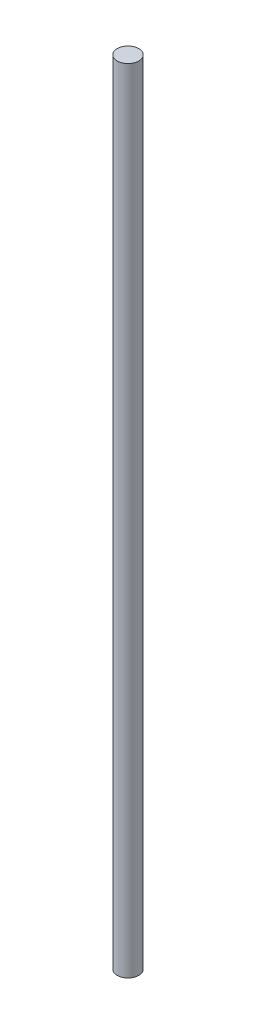
ISO-10303-21;
HEADER;
FILE_DESCRIPTION(('STEP AP214'),'2;1');
FILE_NAME('part.step','',(''),(''),'','','');
FILE_SCHEMA(('AUTOMOTIVE_DESIGN { 1 0 10303 214 1 1 1 1 }'));
ENDSEC;
DATA;
#1=APPLICATION_CONTEXT('core data for automotive mechanical design processes');
#2=APPLICATION_PROTOCOL_DEFINITION('international standard','automotive_design',2000,#1);
#3=PRODUCT_CONTEXT('',#1,'mechanical');
#4=PRODUCT('Part','Part','',(#3));
#5=PRODUCT_RELATED_PRODUCT_CATEGORY('part','',(#4));
#6=PRODUCT_DEFINITION_FORMATION('','',#4);
#7=PRODUCT_DEFINITION_CONTEXT('part definition',#1,'design');
#8=PRODUCT_DEFINITION('design','',#6,#7);
#9=PRODUCT_DEFINITION_SHAPE('','',#8);
#10=(LENGTH_UNIT() NAMED_UNIT(*) SI_UNIT(.MILLI.,.METRE.));
#11=(NAMED_UNIT(*) PLANE_ANGLE_UNIT() SI_UNIT($,.RADIAN.));
#12=(NAMED_UNIT(*) SI_UNIT($,.STERADIAN.) SOLID_ANGLE_UNIT());
#13=UNCERTAINTY_MEASURE_WITH_UNIT(LENGTH_MEASURE(1.E-05),#10,'distance_accuracy_value','');
#14=(GEOMETRIC_REPRESENTATION_CONTEXT(3) GLOBAL_UNCERTAINTY_ASSIGNED_CONTEXT((#13)) GLOBAL_UNIT_ASSIGNED_CONTEXT((#10,
#11,#12)) REPRESENTATION_CONTEXT('',''));
#15=CARTESIAN_POINT('',(0.,0.,0.));
#16=DIRECTION('',(0.,0.,1.));
#17=DIRECTION('',(1.,0.,0.));
#18=AXIS2_PLACEMENT_3D('',#15,#16,#17);
#19=CARTESIAN_POINT('',(0.,79.,0.));
#20=DIRECTION('',(0.,-1.,0.));
#21=DIRECTION('',(0.,0.,-1.));
#22=AXIS2_PLACEMENT_3D('',#19,#20,#21);
#23=CYLINDRICAL_SURFACE('',#22,1.075);
#24=CARTESIAN_POINT('',(0.,79.,0.));
#25=DIRECTION('',(0.,1.,0.));
#26=DIRECTION('',(0.,0.,1.));
#27=AXIS2_PLACEMENT_3D('',#24,#25,#26);
#28=CIRCLE('',#27,1.075);
#29=CARTESIAN_POINT('',(0.,79.,1.075));
#30=VERTEX_POINT('',#29);
#31=EDGE_CURVE('E10',#30,#30,#28,.T.);
#32=ORIENTED_EDGE('',*,*,#31,.F.);
#33=EDGE_LOOP('',(#32));
#34=FACE_BOUND('',#33,.T.);
#35=CARTESIAN_POINT('',(0.,0.,0.));
#36=DIRECTION('',(0.,1.,0.));
#37=DIRECTION('',(0.,0.,1.));
#38=AXIS2_PLACEMENT_3D('',#35,#36,#37);
#39=CIRCLE('',#38,1.075);
#40=CARTESIAN_POINT('',(0.,0.,1.075));
#41=VERTEX_POINT('',#40);
#42=EDGE_CURVE('E46',#41,#41,#39,.T.);
#43=ORIENTED_EDGE('',*,*,#42,.T.);
#44=EDGE_LOOP('',(#43));
#45=FACE_BOUND('',#44,.T.);
#46=ADVANCED_FACE('F43',(#34,#45),#23,.T.);
#47=CARTESIAN_POINT('',(0.,79.,0.));
#48=DIRECTION('',(0.,1.,0.));
#49=DIRECTION('',(0.,0.,1.));
#50=AXIS2_PLACEMENT_3D('',#47,#48,#49);
#51=PLANE('',#50);
#52=ORIENTED_EDGE('',*,*,#31,.T.);
#53=EDGE_LOOP('',(#52));
#54=FACE_BOUND('',#53,.T.);
#55=ADVANCED_FACE('F60',(#54),#51,.T.);
#56=CARTESIAN_POINT('',(0.,0.,0.));
#57=DIRECTION('',(0.,1.,0.));
#58=DIRECTION('',(0.,0.,1.));
#59=AXIS2_PLACEMENT_3D('',#56,#57,#58);
#60=PLANE('',#59);
#61=ORIENTED_EDGE('',*,*,#42,.F.);
#62=EDGE_LOOP('',(#61));
#63=FACE_BOUND('',#62,.T.);
#64=ADVANCED_FACE('F58',(#63),#60,.F.);
#65=CLOSED_SHELL('',(#46,#55,#64));
#66=MANIFOLD_SOLID_BREP('B2',#65);
#67=ADVANCED_BREP_SHAPE_REPRESENTATION('',(#18,#66),#14);
#68=SHAPE_DEFINITION_REPRESENTATION(#9,#67);
ENDSEC;
END-ISO-10303-21;
